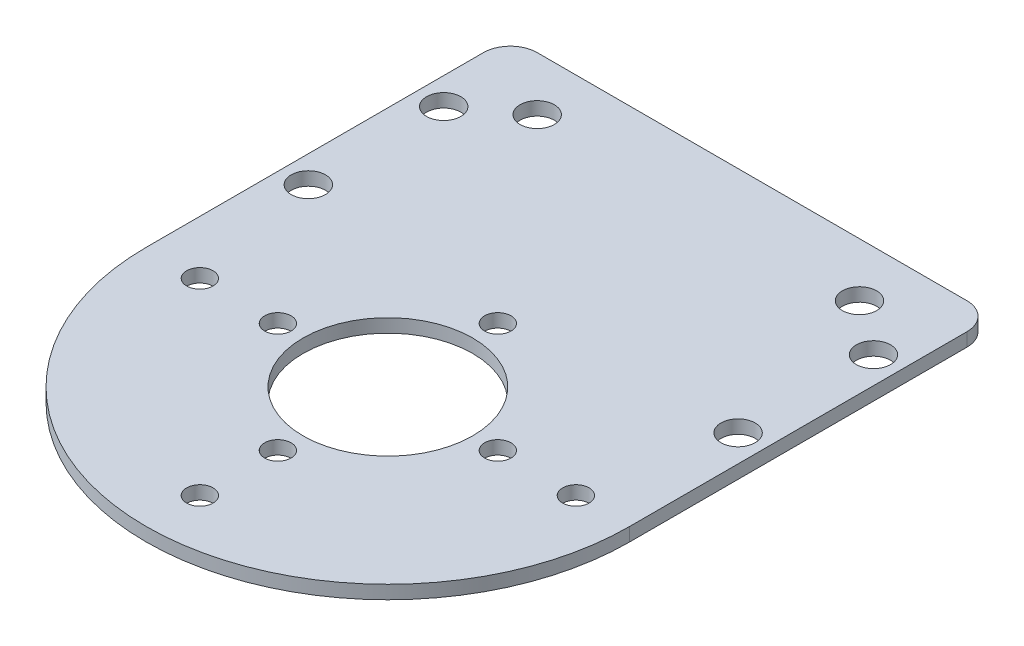
ISO-10303-21;
HEADER;
FILE_DESCRIPTION(('STEP AP214'),'2;1');
FILE_NAME('part.step','',(''),(''),'','','');
FILE_SCHEMA(('AUTOMOTIVE_DESIGN { 1 0 10303 214 1 1 1 1 }'));
ENDSEC;
DATA;
#1=APPLICATION_CONTEXT('core data for automotive mechanical design processes');
#2=APPLICATION_PROTOCOL_DEFINITION('international standard','automotive_design',2000,#1);
#3=PRODUCT_CONTEXT('',#1,'mechanical');
#4=PRODUCT('Part','Part','',(#3));
#5=PRODUCT_RELATED_PRODUCT_CATEGORY('part','',(#4));
#6=PRODUCT_DEFINITION_FORMATION('','',#4);
#7=PRODUCT_DEFINITION_CONTEXT('part definition',#1,'design');
#8=PRODUCT_DEFINITION('design','',#6,#7);
#9=PRODUCT_DEFINITION_SHAPE('','',#8);
#10=(LENGTH_UNIT() NAMED_UNIT(*) SI_UNIT(.MILLI.,.METRE.));
#11=(NAMED_UNIT(*) PLANE_ANGLE_UNIT() SI_UNIT($,.RADIAN.));
#12=(NAMED_UNIT(*) SI_UNIT($,.STERADIAN.) SOLID_ANGLE_UNIT());
#13=UNCERTAINTY_MEASURE_WITH_UNIT(LENGTH_MEASURE(1.E-05),#10,'distance_accuracy_value','');
#14=(GEOMETRIC_REPRESENTATION_CONTEXT(3) GLOBAL_UNCERTAINTY_ASSIGNED_CONTEXT((#13)) GLOBAL_UNIT_ASSIGNED_CONTEXT((#10,
#11,#12)) REPRESENTATION_CONTEXT('',''));
#15=CARTESIAN_POINT('',(0.,0.,0.));
#16=DIRECTION('',(0.,0.,1.));
#17=DIRECTION('',(1.,0.,0.));
#18=AXIS2_PLACEMENT_3D('',#15,#16,#17);
#19=CARTESIAN_POINT('',(0.,1.5875,0.));
#20=DIRECTION('',(0.,1.,0.));
#21=DIRECTION('',(0.,0.,1.));
#22=AXIS2_PLACEMENT_3D('',#19,#20,#21);
#23=PLANE('',#22);
#24=CARTESIAN_POINT('',(-25.4,1.5875,-32.));
#25=DIRECTION('',(0.,1.,0.));
#26=DIRECTION('',(0.,0.,1.));
#27=AXIS2_PLACEMENT_3D('',#24,#25,#26);
#28=CIRCLE('',#27,2.02499999999993);
#29=CARTESIAN_POINT('',(-25.4,1.5875,-29.9750000000001));
#30=VERTEX_POINT('',#29);
#31=EDGE_CURVE('E235',#30,#30,#28,.T.);
#32=ORIENTED_EDGE('',*,*,#31,.F.);
#33=EDGE_LOOP('',(#32));
#34=FACE_BOUND('',#33,.T.);
#35=CARTESIAN_POINT('',(-25.4,1.5875,-16.));
#36=DIRECTION('',(0.,1.,0.));
#37=DIRECTION('',(0.,0.,1.));
#38=AXIS2_PLACEMENT_3D('',#35,#36,#37);
#39=CIRCLE('',#38,2.025);
#40=CARTESIAN_POINT('',(-25.4,1.5875,-13.975));
#41=VERTEX_POINT('',#40);
#42=EDGE_CURVE('E247',#41,#41,#39,.T.);
#43=ORIENTED_EDGE('',*,*,#42,.F.);
#44=EDGE_LOOP('',(#43));
#45=FACE_BOUND('',#44,.T.);
#46=CARTESIAN_POINT('',(19.05,1.5875,-36.7));
#47=DIRECTION('',(0.,1.,0.));
#48=DIRECTION('',(0.,0.,-1.));
#49=AXIS2_PLACEMENT_3D('',#46,#47,#48);
#50=CIRCLE('',#49,2.025);
#51=CARTESIAN_POINT('',(19.05,1.5875,-38.725));
#52=VERTEX_POINT('',#51);
#53=EDGE_CURVE('E259',#52,#52,#50,.T.);
#54=ORIENTED_EDGE('',*,*,#53,.F.);
#55=EDGE_LOOP('',(#54));
#56=FACE_BOUND('',#55,.T.);
#57=CARTESIAN_POINT('',(0.,1.5875,22.225));
#58=DIRECTION('',(0.,1.,0.));
#59=DIRECTION('',(0.,0.,1.));
#60=AXIS2_PLACEMENT_3D('',#57,#58,#59);
#61=CIRCLE('',#60,1.5625);
#62=CARTESIAN_POINT('',(0.,1.5875,23.7875));
#63=VERTEX_POINT('',#62);
#64=EDGE_CURVE('E271',#63,#63,#61,.T.);
#65=ORIENTED_EDGE('',*,*,#64,.F.);
#66=EDGE_LOOP('',(#65));
#67=FACE_BOUND('',#66,.T.);
#68=CARTESIAN_POINT('',(13.,1.5875,0.));
#69=DIRECTION('',(0.,1.,0.));
#70=DIRECTION('',(0.,0.,1.));
#71=AXIS2_PLACEMENT_3D('',#68,#69,#70);
#72=CIRCLE('',#71,1.5625);
#73=CARTESIAN_POINT('',(13.,1.5875,1.5625));
#74=VERTEX_POINT('',#73);
#75=EDGE_CURVE('E283',#74,#74,#72,.T.);
#76=ORIENTED_EDGE('',*,*,#75,.F.);
#77=EDGE_LOOP('',(#76));
#78=FACE_BOUND('',#77,.T.);
#79=CARTESIAN_POINT('',(-13.,1.5875,0.));
#80=DIRECTION('',(0.,1.,0.));
#81=DIRECTION('',(0.,0.,1.));
#82=AXIS2_PLACEMENT_3D('',#79,#80,#81);
#83=CIRCLE('',#82,1.5625);
#84=CARTESIAN_POINT('',(-13.,1.5875,1.5625));
#85=VERTEX_POINT('',#84);
#86=EDGE_CURVE('E295',#85,#85,#83,.T.);
#87=ORIENTED_EDGE('',*,*,#86,.F.);
#88=EDGE_LOOP('',(#87));
#89=FACE_BOUND('',#88,.T.);
#90=CARTESIAN_POINT('',(0.,1.5875,0.));
#91=DIRECTION('',(0.,1.,0.));
#92=DIRECTION('',(0.,0.,1.));
#93=AXIS2_PLACEMENT_3D('',#90,#91,#92);
#94=CIRCLE('',#93,10.025);
#95=CARTESIAN_POINT('',(0.,1.5875,10.025));
#96=VERTEX_POINT('',#95);
#97=EDGE_CURVE('E128',#96,#96,#94,.T.);
#98=ORIENTED_EDGE('',*,*,#97,.F.);
#99=EDGE_LOOP('',(#98));
#100=FACE_BOUND('',#99,.T.);
#101=CARTESIAN_POINT('',(0.,1.5875,0.));
#102=DIRECTION('',(0.,1.,0.));
#103=DIRECTION('',(0.,0.,1.));
#104=AXIS2_PLACEMENT_3D('',#101,#102,#103);
#105=CIRCLE('',#104,28.575);
#106=CARTESIAN_POINT('',(-28.575,1.5875,0.));
#107=VERTEX_POINT('',#106);
#108=CARTESIAN_POINT('',(28.575,1.5875,0.));
#109=VERTEX_POINT('',#108);
#110=EDGE_CURVE('E135',#107,#109,#105,.T.);
#111=ORIENTED_EDGE('',*,*,#110,.T.);
#112=DIRECTION('',(0.,0.,-1.));
#113=VECTOR('',#112,1.);
#114=CARTESIAN_POINT('',(28.575,1.5875,-39.875));
#115=LINE('',#114,#113);
#116=CARTESIAN_POINT('',(28.575,1.5875,-39.875));
#117=VERTEX_POINT('',#116);
#118=EDGE_CURVE('E93',#109,#117,#115,.T.);
#119=ORIENTED_EDGE('',*,*,#118,.T.);
#120=CARTESIAN_POINT('',(25.4,1.5875,-39.875));
#121=DIRECTION('',(0.,1.,0.));
#122=DIRECTION('',(0.,0.,-1.));
#123=AXIS2_PLACEMENT_3D('',#120,#121,#122);
#124=CIRCLE('',#123,3.175);
#125=CARTESIAN_POINT('',(25.4,1.5875,-43.05));
#126=VERTEX_POINT('',#125);
#127=EDGE_CURVE('E106',#117,#126,#124,.T.);
#128=ORIENTED_EDGE('',*,*,#127,.T.);
#129=DIRECTION('',(-1.,0.,0.));
#130=VECTOR('',#129,1.);
#131=CARTESIAN_POINT('',(-25.4,1.5875,-43.05));
#132=LINE('',#131,#130);
#133=CARTESIAN_POINT('',(-25.4,1.5875,-43.05));
#134=VERTEX_POINT('',#133);
#135=EDGE_CURVE('E100',#126,#134,#132,.T.);
#136=ORIENTED_EDGE('',*,*,#135,.T.);
#137=CARTESIAN_POINT('',(-25.4,1.5875,-39.875));
#138=DIRECTION('',(0.,1.,0.));
#139=DIRECTION('',(0.,0.,-1.));
#140=AXIS2_PLACEMENT_3D('',#137,#138,#139);
#141=CIRCLE('',#140,3.175);
#142=CARTESIAN_POINT('',(-28.575,1.5875,-39.875));
#143=VERTEX_POINT('',#142);
#144=EDGE_CURVE('E104',#134,#143,#141,.T.);
#145=ORIENTED_EDGE('',*,*,#144,.T.);
#146=DIRECTION('',(0.,0.,1.));
#147=VECTOR('',#146,1.);
#148=CARTESIAN_POINT('',(-28.575,1.5875,0.));
#149=LINE('',#148,#147);
#150=EDGE_CURVE('E56',#143,#107,#149,.T.);
#151=ORIENTED_EDGE('',*,*,#150,.T.);
#152=EDGE_LOOP('',(#111,#119,#128,#136,#145,#151));
#153=FACE_BOUND('',#152,.T.);
#154=CARTESIAN_POINT('',(0.,1.5875,13.));
#155=DIRECTION('',(0.,1.,0.));
#156=DIRECTION('',(0.,0.,1.));
#157=AXIS2_PLACEMENT_3D('',#154,#155,#156);
#158=CIRCLE('',#157,1.5625);
#159=CARTESIAN_POINT('',(0.,1.5875,14.5625));
#160=VERTEX_POINT('',#159);
#161=EDGE_CURVE('E301',#160,#160,#158,.T.);
#162=ORIENTED_EDGE('',*,*,#161,.F.);
#163=EDGE_LOOP('',(#162));
#164=FACE_BOUND('',#163,.T.);
#165=CARTESIAN_POINT('',(0.,1.5875,-13.));
#166=DIRECTION('',(0.,1.,0.));
#167=DIRECTION('',(0.,0.,1.));
#168=AXIS2_PLACEMENT_3D('',#165,#166,#167);
#169=CIRCLE('',#168,1.5625);
#170=CARTESIAN_POINT('',(0.,1.5875,-11.4375));
#171=VERTEX_POINT('',#170);
#172=EDGE_CURVE('E289',#171,#171,#169,.T.);
#173=ORIENTED_EDGE('',*,*,#172,.F.);
#174=EDGE_LOOP('',(#173));
#175=FACE_BOUND('',#174,.T.);
#176=CARTESIAN_POINT('',(-22.225,1.5875,0.));
#177=DIRECTION('',(0.,1.,0.));
#178=DIRECTION('',(0.,0.,1.));
#179=AXIS2_PLACEMENT_3D('',#176,#177,#178);
#180=CIRCLE('',#179,1.5625);
#181=CARTESIAN_POINT('',(-22.225,1.5875,1.5625));
#182=VERTEX_POINT('',#181);
#183=EDGE_CURVE('E277',#182,#182,#180,.T.);
#184=ORIENTED_EDGE('',*,*,#183,.F.);
#185=EDGE_LOOP('',(#184));
#186=FACE_BOUND('',#185,.T.);
#187=CARTESIAN_POINT('',(22.225,1.5875,0.));
#188=DIRECTION('',(0.,1.,0.));
#189=DIRECTION('',(0.,0.,1.));
#190=AXIS2_PLACEMENT_3D('',#187,#188,#189);
#191=CIRCLE('',#190,1.5625);
#192=CARTESIAN_POINT('',(22.225,1.5875,1.5625));
#193=VERTEX_POINT('',#192);
#194=EDGE_CURVE('E265',#193,#193,#191,.T.);
#195=ORIENTED_EDGE('',*,*,#194,.F.);
#196=EDGE_LOOP('',(#195));
#197=FACE_BOUND('',#196,.T.);
#198=CARTESIAN_POINT('',(25.4,1.5875,-16.));
#199=DIRECTION('',(0.,1.,0.));
#200=DIRECTION('',(0.,0.,1.));
#201=AXIS2_PLACEMENT_3D('',#198,#199,#200);
#202=CIRCLE('',#201,2.02500000000007);
#203=CARTESIAN_POINT('',(25.4,1.5875,-13.9749999999999));
#204=VERTEX_POINT('',#203);
#205=EDGE_CURVE('E253',#204,#204,#202,.T.);
#206=ORIENTED_EDGE('',*,*,#205,.F.);
#207=EDGE_LOOP('',(#206));
#208=FACE_BOUND('',#207,.T.);
#209=CARTESIAN_POINT('',(25.4,1.5875,-32.));
#210=DIRECTION('',(0.,1.,0.));
#211=DIRECTION('',(0.,0.,1.));
#212=AXIS2_PLACEMENT_3D('',#209,#210,#211);
#213=CIRCLE('',#212,2.02499999999999);
#214=CARTESIAN_POINT('',(25.4,1.5875,-29.975));
#215=VERTEX_POINT('',#214);
#216=EDGE_CURVE('E241',#215,#215,#213,.T.);
#217=ORIENTED_EDGE('',*,*,#216,.F.);
#218=EDGE_LOOP('',(#217));
#219=FACE_BOUND('',#218,.T.);
#220=CARTESIAN_POINT('',(-19.05,1.5875,-36.7));
#221=DIRECTION('',(0.,1.,0.));
#222=DIRECTION('',(0.,0.,1.));
#223=AXIS2_PLACEMENT_3D('',#220,#221,#222);
#224=CIRCLE('',#223,2.025);
#225=CARTESIAN_POINT('',(-19.05,1.5875,-34.675));
#226=VERTEX_POINT('',#225);
#227=EDGE_CURVE('E226',#226,#226,#224,.T.);
#228=ORIENTED_EDGE('',*,*,#227,.F.);
#229=EDGE_LOOP('',(#228));
#230=FACE_BOUND('',#229,.T.);
#231=ADVANCED_FACE('F39',(#34,#45,#56,#67,#78,#89,#100,#153,#164,#175,#186,#197,#208,#219,#230),
#23,.T.);
#232=CARTESIAN_POINT('',(0.,0.,0.));
#233=DIRECTION('',(0.,1.,0.));
#234=DIRECTION('',(0.,0.,1.));
#235=AXIS2_PLACEMENT_3D('',#232,#233,#234);
#236=PLANE('',#235);
#237=CARTESIAN_POINT('',(0.,0.,0.));
#238=DIRECTION('',(0.,1.,0.));
#239=DIRECTION('',(0.,0.,1.));
#240=AXIS2_PLACEMENT_3D('',#237,#238,#239);
#241=CIRCLE('',#240,28.575);
#242=CARTESIAN_POINT('',(-28.575,0.,0.));
#243=VERTEX_POINT('',#242);
#244=CARTESIAN_POINT('',(28.575,0.,0.));
#245=VERTEX_POINT('',#244);
#246=EDGE_CURVE('E124',#243,#245,#241,.T.);
#247=ORIENTED_EDGE('',*,*,#246,.F.);
#248=DIRECTION('',(0.,0.,1.));
#249=VECTOR('',#248,1.);
#250=CARTESIAN_POINT('',(-28.575,0.,0.));
#251=LINE('',#250,#249);
#252=CARTESIAN_POINT('',(-28.575,0.,-39.875));
#253=VERTEX_POINT('',#252);
#254=EDGE_CURVE('E85',#253,#243,#251,.T.);
#255=ORIENTED_EDGE('',*,*,#254,.F.);
#256=CARTESIAN_POINT('',(-25.4,0.,-39.875));
#257=DIRECTION('',(0.,1.,0.));
#258=DIRECTION('',(0.,0.,-1.));
#259=AXIS2_PLACEMENT_3D('',#256,#257,#258);
#260=CIRCLE('',#259,3.175);
#261=CARTESIAN_POINT('',(-25.4,0.,-43.05));
#262=VERTEX_POINT('',#261);
#263=EDGE_CURVE('E79',#262,#253,#260,.T.);
#264=ORIENTED_EDGE('',*,*,#263,.F.);
#265=DIRECTION('',(-1.,0.,0.));
#266=VECTOR('',#265,1.);
#267=CARTESIAN_POINT('',(-25.4,0.,-43.05));
#268=LINE('',#267,#266);
#269=CARTESIAN_POINT('',(25.4,0.,-43.05));
#270=VERTEX_POINT('',#269);
#271=EDGE_CURVE('E114',#270,#262,#268,.T.);
#272=ORIENTED_EDGE('',*,*,#271,.F.);
#273=CARTESIAN_POINT('',(25.4,0.,-39.875));
#274=DIRECTION('',(0.,1.,0.));
#275=DIRECTION('',(0.,0.,-1.));
#276=AXIS2_PLACEMENT_3D('',#273,#274,#275);
#277=CIRCLE('',#276,3.175);
#278=CARTESIAN_POINT('',(28.575,0.,-39.875));
#279=VERTEX_POINT('',#278);
#280=EDGE_CURVE('E130',#279,#270,#277,.T.);
#281=ORIENTED_EDGE('',*,*,#280,.F.);
#282=DIRECTION('',(0.,0.,-1.));
#283=VECTOR('',#282,1.);
#284=CARTESIAN_POINT('',(28.575,0.,-39.875));
#285=LINE('',#284,#283);
#286=EDGE_CURVE('E127',#245,#279,#285,.T.);
#287=ORIENTED_EDGE('',*,*,#286,.F.);
#288=EDGE_LOOP('',(#247,#255,#264,#272,#281,#287));
#289=FACE_BOUND('',#288,.T.);
#290=CARTESIAN_POINT('',(0.,0.,0.));
#291=DIRECTION('',(0.,1.,0.));
#292=DIRECTION('',(0.,0.,1.));
#293=AXIS2_PLACEMENT_3D('',#290,#291,#292);
#294=CIRCLE('',#293,10.025);
#295=CARTESIAN_POINT('',(0.,0.,10.025));
#296=VERTEX_POINT('',#295);
#297=EDGE_CURVE('E304',#296,#296,#294,.T.);
#298=ORIENTED_EDGE('',*,*,#297,.T.);
#299=EDGE_LOOP('',(#298));
#300=FACE_BOUND('',#299,.T.);
#301=CARTESIAN_POINT('',(0.,0.,13.));
#302=DIRECTION('',(0.,1.,0.));
#303=DIRECTION('',(0.,0.,1.));
#304=AXIS2_PLACEMENT_3D('',#301,#302,#303);
#305=CIRCLE('',#304,1.5625);
#306=CARTESIAN_POINT('',(0.,0.,14.5625));
#307=VERTEX_POINT('',#306);
#308=EDGE_CURVE('E298',#307,#307,#305,.T.);
#309=ORIENTED_EDGE('',*,*,#308,.T.);
#310=EDGE_LOOP('',(#309));
#311=FACE_BOUND('',#310,.T.);
#312=CARTESIAN_POINT('',(-13.,0.,0.));
#313=DIRECTION('',(0.,1.,0.));
#314=DIRECTION('',(0.,0.,1.));
#315=AXIS2_PLACEMENT_3D('',#312,#313,#314);
#316=CIRCLE('',#315,1.5625);
#317=CARTESIAN_POINT('',(-13.,0.,1.5625));
#318=VERTEX_POINT('',#317);
#319=EDGE_CURVE('E292',#318,#318,#316,.T.);
#320=ORIENTED_EDGE('',*,*,#319,.T.);
#321=EDGE_LOOP('',(#320));
#322=FACE_BOUND('',#321,.T.);
#323=CARTESIAN_POINT('',(0.,0.,-13.));
#324=DIRECTION('',(0.,1.,0.));
#325=DIRECTION('',(0.,0.,1.));
#326=AXIS2_PLACEMENT_3D('',#323,#324,#325);
#327=CIRCLE('',#326,1.5625);
#328=CARTESIAN_POINT('',(0.,0.,-11.4375));
#329=VERTEX_POINT('',#328);
#330=EDGE_CURVE('E286',#329,#329,#327,.T.);
#331=ORIENTED_EDGE('',*,*,#330,.T.);
#332=EDGE_LOOP('',(#331));
#333=FACE_BOUND('',#332,.T.);
#334=CARTESIAN_POINT('',(13.,0.,0.));
#335=DIRECTION('',(0.,1.,0.));
#336=DIRECTION('',(0.,0.,1.));
#337=AXIS2_PLACEMENT_3D('',#334,#335,#336);
#338=CIRCLE('',#337,1.5625);
#339=CARTESIAN_POINT('',(13.,0.,1.5625));
#340=VERTEX_POINT('',#339);
#341=EDGE_CURVE('E280',#340,#340,#338,.T.);
#342=ORIENTED_EDGE('',*,*,#341,.T.);
#343=EDGE_LOOP('',(#342));
#344=FACE_BOUND('',#343,.T.);
#345=CARTESIAN_POINT('',(-22.225,0.,0.));
#346=DIRECTION('',(0.,1.,0.));
#347=DIRECTION('',(0.,0.,1.));
#348=AXIS2_PLACEMENT_3D('',#345,#346,#347);
#349=CIRCLE('',#348,1.5625);
#350=CARTESIAN_POINT('',(-22.225,0.,1.5625));
#351=VERTEX_POINT('',#350);
#352=EDGE_CURVE('E274',#351,#351,#349,.T.);
#353=ORIENTED_EDGE('',*,*,#352,.T.);
#354=EDGE_LOOP('',(#353));
#355=FACE_BOUND('',#354,.T.);
#356=CARTESIAN_POINT('',(0.,0.,22.225));
#357=DIRECTION('',(0.,1.,0.));
#358=DIRECTION('',(0.,0.,1.));
#359=AXIS2_PLACEMENT_3D('',#356,#357,#358);
#360=CIRCLE('',#359,1.5625);
#361=CARTESIAN_POINT('',(0.,0.,23.7875));
#362=VERTEX_POINT('',#361);
#363=EDGE_CURVE('E268',#362,#362,#360,.T.);
#364=ORIENTED_EDGE('',*,*,#363,.T.);
#365=EDGE_LOOP('',(#364));
#366=FACE_BOUND('',#365,.T.);
#367=CARTESIAN_POINT('',(22.225,0.,0.));
#368=DIRECTION('',(0.,1.,0.));
#369=DIRECTION('',(0.,0.,1.));
#370=AXIS2_PLACEMENT_3D('',#367,#368,#369);
#371=CIRCLE('',#370,1.5625);
#372=CARTESIAN_POINT('',(22.225,0.,1.5625));
#373=VERTEX_POINT('',#372);
#374=EDGE_CURVE('E262',#373,#373,#371,.T.);
#375=ORIENTED_EDGE('',*,*,#374,.T.);
#376=EDGE_LOOP('',(#375));
#377=FACE_BOUND('',#376,.T.);
#378=CARTESIAN_POINT('',(19.05,0.,-36.7));
#379=DIRECTION('',(0.,1.,0.));
#380=DIRECTION('',(0.,0.,-1.));
#381=AXIS2_PLACEMENT_3D('',#378,#379,#380);
#382=CIRCLE('',#381,2.025);
#383=CARTESIAN_POINT('',(19.05,0.,-38.725));
#384=VERTEX_POINT('',#383);
#385=EDGE_CURVE('E256',#384,#384,#382,.T.);
#386=ORIENTED_EDGE('',*,*,#385,.T.);
#387=EDGE_LOOP('',(#386));
#388=FACE_BOUND('',#387,.T.);
#389=CARTESIAN_POINT('',(25.4,0.,-16.));
#390=DIRECTION('',(0.,1.,0.));
#391=DIRECTION('',(0.,0.,1.));
#392=AXIS2_PLACEMENT_3D('',#389,#390,#391);
#393=CIRCLE('',#392,2.02500000000007);
#394=CARTESIAN_POINT('',(25.4,0.,-13.9749999999999));
#395=VERTEX_POINT('',#394);
#396=EDGE_CURVE('E250',#395,#395,#393,.T.);
#397=ORIENTED_EDGE('',*,*,#396,.T.);
#398=EDGE_LOOP('',(#397));
#399=FACE_BOUND('',#398,.T.);
#400=CARTESIAN_POINT('',(-25.4,0.,-16.));
#401=DIRECTION('',(0.,1.,0.));
#402=DIRECTION('',(0.,0.,1.));
#403=AXIS2_PLACEMENT_3D('',#400,#401,#402);
#404=CIRCLE('',#403,2.025);
#405=CARTESIAN_POINT('',(-25.4,0.,-13.975));
#406=VERTEX_POINT('',#405);
#407=EDGE_CURVE('E244',#406,#406,#404,.T.);
#408=ORIENTED_EDGE('',*,*,#407,.T.);
#409=EDGE_LOOP('',(#408));
#410=FACE_BOUND('',#409,.T.);
#411=CARTESIAN_POINT('',(25.4,0.,-32.));
#412=DIRECTION('',(0.,1.,0.));
#413=DIRECTION('',(0.,0.,1.));
#414=AXIS2_PLACEMENT_3D('',#411,#412,#413);
#415=CIRCLE('',#414,2.02499999999999);
#416=CARTESIAN_POINT('',(25.4,0.,-29.975));
#417=VERTEX_POINT('',#416);
#418=EDGE_CURVE('E238',#417,#417,#415,.T.);
#419=ORIENTED_EDGE('',*,*,#418,.T.);
#420=EDGE_LOOP('',(#419));
#421=FACE_BOUND('',#420,.T.);
#422=CARTESIAN_POINT('',(-25.4,0.,-32.));
#423=DIRECTION('',(0.,1.,0.));
#424=DIRECTION('',(0.,0.,1.));
#425=AXIS2_PLACEMENT_3D('',#422,#423,#424);
#426=CIRCLE('',#425,2.02499999999993);
#427=CARTESIAN_POINT('',(-25.4,0.,-29.9750000000001));
#428=VERTEX_POINT('',#427);
#429=EDGE_CURVE('E232',#428,#428,#426,.T.);
#430=ORIENTED_EDGE('',*,*,#429,.T.);
#431=EDGE_LOOP('',(#430));
#432=FACE_BOUND('',#431,.T.);
#433=CARTESIAN_POINT('',(-19.05,0.,-36.7));
#434=DIRECTION('',(0.,1.,0.));
#435=DIRECTION('',(0.,0.,1.));
#436=AXIS2_PLACEMENT_3D('',#433,#434,#435);
#437=CIRCLE('',#436,2.025);
#438=CARTESIAN_POINT('',(-19.05,0.,-34.675));
#439=VERTEX_POINT('',#438);
#440=EDGE_CURVE('E229',#439,#439,#437,.T.);
#441=ORIENTED_EDGE('',*,*,#440,.T.);
#442=EDGE_LOOP('',(#441));
#443=FACE_BOUND('',#442,.T.);
#444=ADVANCED_FACE('F144',(#289,#300,#311,#322,#333,#344,#355,#366,#377,#388,#399,#410,#421,
#432,#443),#236,.F.);
#445=CARTESIAN_POINT('',(0.,1.5875,0.));
#446=DIRECTION('',(0.,-1.,0.));
#447=DIRECTION('',(0.,0.,-1.));
#448=AXIS2_PLACEMENT_3D('',#445,#446,#447);
#449=CYLINDRICAL_SURFACE('',#448,28.575);
#450=ORIENTED_EDGE('',*,*,#246,.T.);
#451=DIRECTION('',(0.,-1.,0.));
#452=VECTOR('',#451,1.);
#453=CARTESIAN_POINT('',(28.575,1.5875,0.));
#454=LINE('',#453,#452);
#455=EDGE_CURVE('E11',#109,#245,#454,.T.);
#456=ORIENTED_EDGE('',*,*,#455,.F.);
#457=ORIENTED_EDGE('',*,*,#110,.F.);
#458=DIRECTION('',(0.,-1.,0.));
#459=VECTOR('',#458,1.);
#460=CARTESIAN_POINT('',(-28.575,1.5875,0.));
#461=LINE('',#460,#459);
#462=EDGE_CURVE('E120',#107,#243,#461,.T.);
#463=ORIENTED_EDGE('',*,*,#462,.T.);
#464=EDGE_LOOP('',(#450,#456,#457,#463));
#465=FACE_BOUND('',#464,.T.);
#466=ADVANCED_FACE('F41',(#465),#449,.T.);
#467=CARTESIAN_POINT('',(28.575,1.5875,-39.875));
#468=DIRECTION('',(-1.,0.,0.));
#469=DIRECTION('',(0.,0.,1.));
#470=AXIS2_PLACEMENT_3D('',#467,#468,#469);
#471=PLANE('',#470);
#472=ORIENTED_EDGE('',*,*,#286,.T.);
#473=DIRECTION('',(0.,-1.,0.));
#474=VECTOR('',#473,1.);
#475=CARTESIAN_POINT('',(28.575,1.5875,-39.875));
#476=LINE('',#475,#474);
#477=EDGE_CURVE('E48',#117,#279,#476,.T.);
#478=ORIENTED_EDGE('',*,*,#477,.F.);
#479=ORIENTED_EDGE('',*,*,#118,.F.);
#480=ORIENTED_EDGE('',*,*,#455,.T.);
#481=EDGE_LOOP('',(#472,#478,#479,#480));
#482=FACE_BOUND('',#481,.T.);
#483=ADVANCED_FACE('F466',(#482),#471,.F.);
#484=CARTESIAN_POINT('',(25.4,1.5875,-39.875));
#485=DIRECTION('',(0.,-1.,0.));
#486=DIRECTION('',(0.,0.,-1.));
#487=AXIS2_PLACEMENT_3D('',#484,#485,#486);
#488=CYLINDRICAL_SURFACE('',#487,3.175);
#489=ORIENTED_EDGE('',*,*,#280,.T.);
#490=DIRECTION('',(0.,-1.,0.));
#491=VECTOR('',#490,1.);
#492=CARTESIAN_POINT('',(25.4,1.5875,-43.05));
#493=LINE('',#492,#491);
#494=EDGE_CURVE('E115',#126,#270,#493,.T.);
#495=ORIENTED_EDGE('',*,*,#494,.F.);
#496=ORIENTED_EDGE('',*,*,#127,.F.);
#497=ORIENTED_EDGE('',*,*,#477,.T.);
#498=EDGE_LOOP('',(#489,#495,#496,#497));
#499=FACE_BOUND('',#498,.T.);
#500=ADVANCED_FACE('F141',(#499),#488,.T.);
#501=CARTESIAN_POINT('',(-25.4,1.5875,-43.05));
#502=DIRECTION('',(0.,0.,1.));
#503=DIRECTION('',(1.,0.,0.));
#504=AXIS2_PLACEMENT_3D('',#501,#502,#503);
#505=PLANE('',#504);
#506=ORIENTED_EDGE('',*,*,#271,.T.);
#507=DIRECTION('',(0.,-1.,0.));
#508=VECTOR('',#507,1.);
#509=CARTESIAN_POINT('',(-25.4,1.5875,-43.05));
#510=LINE('',#509,#508);
#511=EDGE_CURVE('E111',#134,#262,#510,.T.);
#512=ORIENTED_EDGE('',*,*,#511,.F.);
#513=ORIENTED_EDGE('',*,*,#135,.F.);
#514=ORIENTED_EDGE('',*,*,#494,.T.);
#515=EDGE_LOOP('',(#506,#512,#513,#514));
#516=FACE_BOUND('',#515,.T.);
#517=ADVANCED_FACE('F112',(#516),#505,.F.);
#518=CARTESIAN_POINT('',(-25.4,1.5875,-39.875));
#519=DIRECTION('',(0.,-1.,0.));
#520=DIRECTION('',(0.,0.,-1.));
#521=AXIS2_PLACEMENT_3D('',#518,#519,#520);
#522=CYLINDRICAL_SURFACE('',#521,3.175);
#523=ORIENTED_EDGE('',*,*,#263,.T.);
#524=DIRECTION('',(0.,-1.,0.));
#525=VECTOR('',#524,1.);
#526=CARTESIAN_POINT('',(-28.575,1.5875,-39.875));
#527=LINE('',#526,#525);
#528=EDGE_CURVE('E116',#143,#253,#527,.T.);
#529=ORIENTED_EDGE('',*,*,#528,.F.);
#530=ORIENTED_EDGE('',*,*,#144,.F.);
#531=ORIENTED_EDGE('',*,*,#511,.T.);
#532=EDGE_LOOP('',(#523,#529,#530,#531));
#533=FACE_BOUND('',#532,.T.);
#534=ADVANCED_FACE('F118',(#533),#522,.T.);
#535=CARTESIAN_POINT('',(-28.575,1.5875,0.));
#536=DIRECTION('',(1.,0.,0.));
#537=DIRECTION('',(0.,0.,-1.));
#538=AXIS2_PLACEMENT_3D('',#535,#536,#537);
#539=PLANE('',#538);
#540=ORIENTED_EDGE('',*,*,#254,.T.);
#541=ORIENTED_EDGE('',*,*,#462,.F.);
#542=ORIENTED_EDGE('',*,*,#150,.F.);
#543=ORIENTED_EDGE('',*,*,#528,.T.);
#544=EDGE_LOOP('',(#540,#541,#542,#543));
#545=FACE_BOUND('',#544,.T.);
#546=ADVANCED_FACE('F149',(#545),#539,.F.);
#547=CARTESIAN_POINT('',(0.,1.5875,0.));
#548=DIRECTION('',(0.,-1.,0.));
#549=DIRECTION('',(0.,0.,-1.));
#550=AXIS2_PLACEMENT_3D('',#547,#548,#549);
#551=CYLINDRICAL_SURFACE('',#550,10.025);
#552=ORIENTED_EDGE('',*,*,#97,.T.);
#553=EDGE_LOOP('',(#552));
#554=FACE_BOUND('',#553,.T.);
#555=ORIENTED_EDGE('',*,*,#297,.F.);
#556=EDGE_LOOP('',(#555));
#557=FACE_BOUND('',#556,.T.);
#558=ADVANCED_FACE('F151',(#554,#557),#551,.F.);
#559=CARTESIAN_POINT('',(0.,1.5875,13.));
#560=DIRECTION('',(0.,-1.,0.));
#561=DIRECTION('',(0.,0.,-1.));
#562=AXIS2_PLACEMENT_3D('',#559,#560,#561);
#563=CYLINDRICAL_SURFACE('',#562,1.5625);
#564=ORIENTED_EDGE('',*,*,#161,.T.);
#565=EDGE_LOOP('',(#564));
#566=FACE_BOUND('',#565,.T.);
#567=ORIENTED_EDGE('',*,*,#308,.F.);
#568=EDGE_LOOP('',(#567));
#569=FACE_BOUND('',#568,.T.);
#570=ADVANCED_FACE('F157',(#566,#569),#563,.F.);
#571=CARTESIAN_POINT('',(-13.,1.5875,0.));
#572=DIRECTION('',(0.,-1.,0.));
#573=DIRECTION('',(0.,0.,-1.));
#574=AXIS2_PLACEMENT_3D('',#571,#572,#573);
#575=CYLINDRICAL_SURFACE('',#574,1.5625);
#576=ORIENTED_EDGE('',*,*,#86,.T.);
#577=EDGE_LOOP('',(#576));
#578=FACE_BOUND('',#577,.T.);
#579=ORIENTED_EDGE('',*,*,#319,.F.);
#580=EDGE_LOOP('',(#579));
#581=FACE_BOUND('',#580,.T.);
#582=ADVANCED_FACE('F173',(#578,#581),#575,.F.);
#583=CARTESIAN_POINT('',(0.,1.5875,-13.));
#584=DIRECTION('',(0.,-1.,0.));
#585=DIRECTION('',(0.,0.,-1.));
#586=AXIS2_PLACEMENT_3D('',#583,#584,#585);
#587=CYLINDRICAL_SURFACE('',#586,1.5625);
#588=ORIENTED_EDGE('',*,*,#172,.T.);
#589=EDGE_LOOP('',(#588));
#590=FACE_BOUND('',#589,.T.);
#591=ORIENTED_EDGE('',*,*,#330,.F.);
#592=EDGE_LOOP('',(#591));
#593=FACE_BOUND('',#592,.T.);
#594=ADVANCED_FACE('F177',(#590,#593),#587,.F.);
#595=CARTESIAN_POINT('',(13.,1.5875,0.));
#596=DIRECTION('',(0.,-1.,0.));
#597=DIRECTION('',(0.,0.,-1.));
#598=AXIS2_PLACEMENT_3D('',#595,#596,#597);
#599=CYLINDRICAL_SURFACE('',#598,1.5625);
#600=ORIENTED_EDGE('',*,*,#75,.T.);
#601=EDGE_LOOP('',(#600));
#602=FACE_BOUND('',#601,.T.);
#603=ORIENTED_EDGE('',*,*,#341,.F.);
#604=EDGE_LOOP('',(#603));
#605=FACE_BOUND('',#604,.T.);
#606=ADVANCED_FACE('F181',(#602,#605),#599,.F.);
#607=CARTESIAN_POINT('',(-22.225,1.5875,0.));
#608=DIRECTION('',(0.,-1.,0.));
#609=DIRECTION('',(0.,0.,-1.));
#610=AXIS2_PLACEMENT_3D('',#607,#608,#609);
#611=CYLINDRICAL_SURFACE('',#610,1.5625);
#612=ORIENTED_EDGE('',*,*,#183,.T.);
#613=EDGE_LOOP('',(#612));
#614=FACE_BOUND('',#613,.T.);
#615=ORIENTED_EDGE('',*,*,#352,.F.);
#616=EDGE_LOOP('',(#615));
#617=FACE_BOUND('',#616,.T.);
#618=ADVANCED_FACE('F185',(#614,#617),#611,.F.);
#619=CARTESIAN_POINT('',(0.,1.5875,22.225));
#620=DIRECTION('',(0.,-1.,0.));
#621=DIRECTION('',(0.,0.,-1.));
#622=AXIS2_PLACEMENT_3D('',#619,#620,#621);
#623=CYLINDRICAL_SURFACE('',#622,1.5625);
#624=ORIENTED_EDGE('',*,*,#64,.T.);
#625=EDGE_LOOP('',(#624));
#626=FACE_BOUND('',#625,.T.);
#627=ORIENTED_EDGE('',*,*,#363,.F.);
#628=EDGE_LOOP('',(#627));
#629=FACE_BOUND('',#628,.T.);
#630=ADVANCED_FACE('F189',(#626,#629),#623,.F.);
#631=CARTESIAN_POINT('',(22.225,1.5875,0.));
#632=DIRECTION('',(0.,-1.,0.));
#633=DIRECTION('',(0.,0.,-1.));
#634=AXIS2_PLACEMENT_3D('',#631,#632,#633);
#635=CYLINDRICAL_SURFACE('',#634,1.5625);
#636=ORIENTED_EDGE('',*,*,#194,.T.);
#637=EDGE_LOOP('',(#636));
#638=FACE_BOUND('',#637,.T.);
#639=ORIENTED_EDGE('',*,*,#374,.F.);
#640=EDGE_LOOP('',(#639));
#641=FACE_BOUND('',#640,.T.);
#642=ADVANCED_FACE('F193',(#638,#641),#635,.F.);
#643=CARTESIAN_POINT('',(19.05,1.5875,-36.7));
#644=DIRECTION('',(0.,-1.,0.));
#645=DIRECTION('',(0.,0.,-1.));
#646=AXIS2_PLACEMENT_3D('',#643,#644,#645);
#647=CYLINDRICAL_SURFACE('',#646,2.025);
#648=ORIENTED_EDGE('',*,*,#53,.T.);
#649=EDGE_LOOP('',(#648));
#650=FACE_BOUND('',#649,.T.);
#651=ORIENTED_EDGE('',*,*,#385,.F.);
#652=EDGE_LOOP('',(#651));
#653=FACE_BOUND('',#652,.T.);
#654=ADVANCED_FACE('F197',(#650,#653),#647,.F.);
#655=CARTESIAN_POINT('',(25.4,1.5875,-16.));
#656=DIRECTION('',(0.,-1.,0.));
#657=DIRECTION('',(0.,0.,-1.));
#658=AXIS2_PLACEMENT_3D('',#655,#656,#657);
#659=CYLINDRICAL_SURFACE('',#658,2.02500000000007);
#660=ORIENTED_EDGE('',*,*,#205,.T.);
#661=EDGE_LOOP('',(#660));
#662=FACE_BOUND('',#661,.T.);
#663=ORIENTED_EDGE('',*,*,#396,.F.);
#664=EDGE_LOOP('',(#663));
#665=FACE_BOUND('',#664,.T.);
#666=ADVANCED_FACE('F201',(#662,#665),#659,.F.);
#667=CARTESIAN_POINT('',(-25.4,1.5875,-16.));
#668=DIRECTION('',(0.,-1.,0.));
#669=DIRECTION('',(0.,0.,-1.));
#670=AXIS2_PLACEMENT_3D('',#667,#668,#669);
#671=CYLINDRICAL_SURFACE('',#670,2.025);
#672=ORIENTED_EDGE('',*,*,#42,.T.);
#673=EDGE_LOOP('',(#672));
#674=FACE_BOUND('',#673,.T.);
#675=ORIENTED_EDGE('',*,*,#407,.F.);
#676=EDGE_LOOP('',(#675));
#677=FACE_BOUND('',#676,.T.);
#678=ADVANCED_FACE('F205',(#674,#677),#671,.F.);
#679=CARTESIAN_POINT('',(25.4,1.5875,-32.));
#680=DIRECTION('',(0.,-1.,0.));
#681=DIRECTION('',(0.,0.,-1.));
#682=AXIS2_PLACEMENT_3D('',#679,#680,#681);
#683=CYLINDRICAL_SURFACE('',#682,2.02499999999999);
#684=ORIENTED_EDGE('',*,*,#216,.T.);
#685=EDGE_LOOP('',(#684));
#686=FACE_BOUND('',#685,.T.);
#687=ORIENTED_EDGE('',*,*,#418,.F.);
#688=EDGE_LOOP('',(#687));
#689=FACE_BOUND('',#688,.T.);
#690=ADVANCED_FACE('F209',(#686,#689),#683,.F.);
#691=CARTESIAN_POINT('',(-25.4,1.5875,-32.));
#692=DIRECTION('',(0.,-1.,0.));
#693=DIRECTION('',(0.,0.,-1.));
#694=AXIS2_PLACEMENT_3D('',#691,#692,#693);
#695=CYLINDRICAL_SURFACE('',#694,2.02499999999993);
#696=ORIENTED_EDGE('',*,*,#31,.T.);
#697=EDGE_LOOP('',(#696));
#698=FACE_BOUND('',#697,.T.);
#699=ORIENTED_EDGE('',*,*,#429,.F.);
#700=EDGE_LOOP('',(#699));
#701=FACE_BOUND('',#700,.T.);
#702=ADVANCED_FACE('F213',(#698,#701),#695,.F.);
#703=CARTESIAN_POINT('',(-19.05,1.5875,-36.7));
#704=DIRECTION('',(0.,-1.,0.));
#705=DIRECTION('',(0.,0.,-1.));
#706=AXIS2_PLACEMENT_3D('',#703,#704,#705);
#707=CYLINDRICAL_SURFACE('',#706,2.025);
#708=ORIENTED_EDGE('',*,*,#227,.T.);
#709=EDGE_LOOP('',(#708));
#710=FACE_BOUND('',#709,.T.);
#711=ORIENTED_EDGE('',*,*,#440,.F.);
#712=EDGE_LOOP('',(#711));
#713=FACE_BOUND('',#712,.T.);
#714=ADVANCED_FACE('F217',(#710,#713),#707,.F.);
#715=CLOSED_SHELL('',(#231,#444,#466,#483,#500,#517,#534,#546,#558,#570,#582,#594,#606,#618,
#630,#642,#654,#666,#678,#690,#702,#714));
#716=MANIFOLD_SOLID_BREP('B2',#715);
#717=ADVANCED_BREP_SHAPE_REPRESENTATION('',(#18,#716),#14);
#718=SHAPE_DEFINITION_REPRESENTATION(#9,#717);
ENDSEC;
END-ISO-10303-21;
